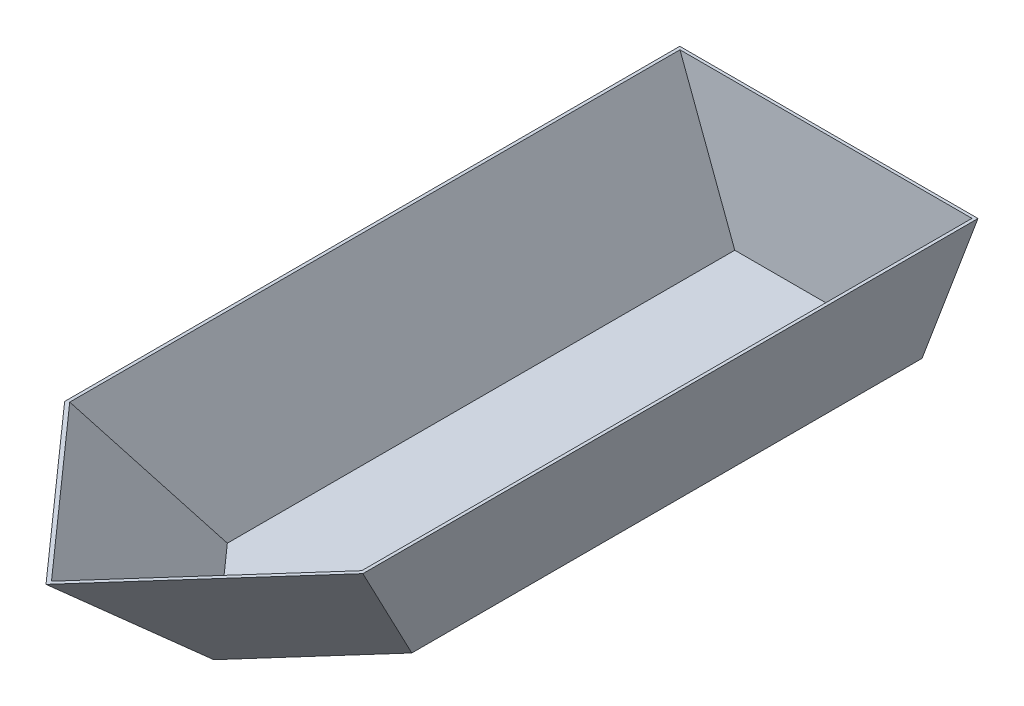
ISO-10303-21;
HEADER;
FILE_DESCRIPTION(('STEP AP214'),'2;1');
FILE_NAME('part.step','',(''),(''),'','','');
FILE_SCHEMA(('AUTOMOTIVE_DESIGN { 1 0 10303 214 1 1 1 1 }'));
ENDSEC;
DATA;
#1=APPLICATION_CONTEXT('core data for automotive mechanical design processes');
#2=APPLICATION_PROTOCOL_DEFINITION('international standard','automotive_design',2000,#1);
#3=PRODUCT_CONTEXT('',#1,'mechanical');
#4=PRODUCT('Part','Part','',(#3));
#5=PRODUCT_RELATED_PRODUCT_CATEGORY('part','',(#4));
#6=PRODUCT_DEFINITION_FORMATION('','',#4);
#7=PRODUCT_DEFINITION_CONTEXT('part definition',#1,'design');
#8=PRODUCT_DEFINITION('design','',#6,#7);
#9=PRODUCT_DEFINITION_SHAPE('','',#8);
#10=(LENGTH_UNIT() NAMED_UNIT(*) SI_UNIT(.MILLI.,.METRE.));
#11=(NAMED_UNIT(*) PLANE_ANGLE_UNIT() SI_UNIT($,.RADIAN.));
#12=(NAMED_UNIT(*) SI_UNIT($,.STERADIAN.) SOLID_ANGLE_UNIT());
#13=UNCERTAINTY_MEASURE_WITH_UNIT(LENGTH_MEASURE(1.E-05),#10,'distance_accuracy_value','');
#14=(GEOMETRIC_REPRESENTATION_CONTEXT(3) GLOBAL_UNCERTAINTY_ASSIGNED_CONTEXT((#13)) GLOBAL_UNIT_ASSIGNED_CONTEXT((#10,
#11,#12)) REPRESENTATION_CONTEXT('',''));
#15=CARTESIAN_POINT('',(0.,0.,0.));
#16=DIRECTION('',(0.,0.,1.));
#17=DIRECTION('',(1.,0.,0.));
#18=AXIS2_PLACEMENT_3D('',#15,#16,#17);
#19=CARTESIAN_POINT('',(660.4,406.4,2133.6));
#20=DIRECTION('',(0.,-1.,0.));
#21=DIRECTION('',(0.,0.,-1.));
#22=AXIS2_PLACEMENT_3D('',#19,#20,#21);
#23=PLANE('',#22);
#24=DIRECTION('',(0.66436383882992,0.,0.74740931868366));
#25=VECTOR('',#24,1.);
#26=CARTESIAN_POINT('',(-1501.75378137035,406.4,158.376995958358));
#27=LINE('',#26,#25);
#28=CARTESIAN_POINT('',(-152.4,406.4,1676.4));
#29=VERTEX_POINT('',#28);
#30=CARTESIAN_POINT('',(253.999999999999,406.4,2133.6));
#31=VERTEX_POINT('',#30);
#32=EDGE_CURVE('E167',#29,#31,#27,.T.);
#33=ORIENTED_EDGE('',*,*,#32,.T.);
#34=DIRECTION('',(-0.66436383882992,0.,0.74740931868366));
#35=VECTOR('',#34,1.);
#36=CARTESIAN_POINT('',(2009.75378137035,406.4,158.376995958358));
#37=LINE('',#36,#35);
#38=CARTESIAN_POINT('',(660.4,406.4,1676.4));
#39=VERTEX_POINT('',#38);
#40=EDGE_CURVE('E135',#39,#31,#37,.T.);
#41=ORIENTED_EDGE('',*,*,#40,.F.);
#42=DIRECTION('',(0.,0.,-1.));
#43=VECTOR('',#42,1.);
#44=CARTESIAN_POINT('',(660.4,406.4,2133.6));
#45=LINE('',#44,#43);
#46=CARTESIAN_POINT('',(660.4,406.4,0.));
#47=VERTEX_POINT('',#46);
#48=EDGE_CURVE('E183',#39,#47,#45,.T.);
#49=ORIENTED_EDGE('',*,*,#48,.T.);
#50=DIRECTION('',(-1.,0.,0.));
#51=VECTOR('',#50,1.);
#52=CARTESIAN_POINT('',(660.4,406.4,0.));
#53=LINE('',#52,#51);
#54=CARTESIAN_POINT('',(-152.4,406.4,0.));
#55=VERTEX_POINT('',#54);
#56=EDGE_CURVE('E180',#47,#55,#53,.T.);
#57=ORIENTED_EDGE('',*,*,#56,.T.);
#58=DIRECTION('',(0.,0.,-1.));
#59=VECTOR('',#58,1.);
#60=CARTESIAN_POINT('',(-152.4,406.4,2133.6));
#61=LINE('',#60,#59);
#62=EDGE_CURVE('E56',#29,#55,#61,.T.);
#63=ORIENTED_EDGE('',*,*,#62,.F.);
#64=EDGE_LOOP('',(#33,#41,#49,#57,#63));
#65=FACE_BOUND('',#64,.T.);
#66=DIRECTION('',(0.66436383882992,0.,0.74740931868366));
#67=VECTOR('',#66,1.);
#68=CARTESIAN_POINT('',(-1494.34729095635,406.4,151.793448923691));
#69=LINE('',#68,#67);
#70=CARTESIAN_POINT('',(-143.922746283943,406.4,1671.02106168015));
#71=VERTEX_POINT('',#70);
#72=CARTESIAN_POINT('',(254.,406.4,2118.68415124958));
#73=VERTEX_POINT('',#72);
#74=EDGE_CURVE('E120',#71,#73,#69,.T.);
#75=ORIENTED_EDGE('',*,*,#74,.F.);
#76=DIRECTION('',(0.,0.,-1.));
#77=VECTOR('',#76,1.);
#78=CARTESIAN_POINT('',(-143.922746283943,406.4,2133.6));
#79=LINE('',#78,#77);
#80=CARTESIAN_POINT('',(-143.922746283943,406.4,7.9375));
#81=VERTEX_POINT('',#80);
#82=EDGE_CURVE('E116',#71,#81,#79,.T.);
#83=ORIENTED_EDGE('',*,*,#82,.T.);
#84=DIRECTION('',(-1.,0.,0.));
#85=VECTOR('',#84,1.);
#86=CARTESIAN_POINT('',(660.4,406.4,7.93750000000015));
#87=LINE('',#86,#85);
#88=CARTESIAN_POINT('',(651.922746283943,406.4,7.9375));
#89=VERTEX_POINT('',#88);
#90=EDGE_CURVE('E149',#89,#81,#87,.T.);
#91=ORIENTED_EDGE('',*,*,#90,.F.);
#92=DIRECTION('',(0.,0.,-1.));
#93=VECTOR('',#92,1.);
#94=CARTESIAN_POINT('',(651.922746283943,406.4,2133.6));
#95=LINE('',#94,#93);
#96=CARTESIAN_POINT('',(651.922746283943,406.4,1671.02106168015));
#97=VERTEX_POINT('',#96);
#98=EDGE_CURVE('E137',#97,#89,#95,.T.);
#99=ORIENTED_EDGE('',*,*,#98,.F.);
#100=DIRECTION('',(-0.66436383882992,0.,0.74740931868366));
#101=VECTOR('',#100,1.);
#102=CARTESIAN_POINT('',(2002.34729095635,406.4,151.793448923691));
#103=LINE('',#102,#101);
#104=EDGE_CURVE('E142',#97,#73,#103,.T.);
#105=ORIENTED_EDGE('',*,*,#104,.T.);
#106=EDGE_LOOP('',(#75,#83,#91,#99,#105));
#107=FACE_BOUND('',#106,.T.);
#108=ADVANCED_FACE('F33',(#65,#107),#23,.F.);
#109=CARTESIAN_POINT('',(-152.4,406.4,2133.6));
#110=DIRECTION('',(0.936329177569045,0.351123441588392,0.));
#111=DIRECTION('',(-0.351123441588392,0.936329177569045,0.));
#112=AXIS2_PLACEMENT_3D('',#109,#110,#111);
#113=PLANE('',#112);
#114=DIRECTION('',(0.293272331791282,-0.78205955144342,-0.549885622108654));
#115=VECTOR('',#114,1.);
#116=CARTESIAN_POINT('',(-226.13092429446,603.015798118561,1814.64548305211));
#117=LINE('',#116,#115);
#118=CARTESIAN_POINT('',(2.22044604925031E-13,0.,1390.65));
#119=VERTEX_POINT('',#118);
#120=EDGE_CURVE('E170',#29,#119,#117,.T.);
#121=ORIENTED_EDGE('',*,*,#120,.F.);
#122=ORIENTED_EDGE('',*,*,#62,.T.);
#123=DIRECTION('',(0.351123441588392,-0.936329177569045,0.));
#124=VECTOR('',#123,1.);
#125=CARTESIAN_POINT('',(-152.4,406.4,0.));
#126=LINE('',#125,#124);
#127=CARTESIAN_POINT('',(0.,0.,0.));
#128=VERTEX_POINT('',#127);
#129=EDGE_CURVE('E172',#55,#128,#126,.T.);
#130=ORIENTED_EDGE('',*,*,#129,.T.);
#131=DIRECTION('',(0.,0.,-1.));
#132=VECTOR('',#131,1.);
#133=CARTESIAN_POINT('',(0.,0.,2133.6));
#134=LINE('',#133,#132);
#135=EDGE_CURVE('E41',#119,#128,#134,.T.);
#136=ORIENTED_EDGE('',*,*,#135,.F.);
#137=EDGE_LOOP('',(#121,#122,#130,#136));
#138=FACE_BOUND('',#137,.T.);
#139=ADVANCED_FACE('F35',(#138),#113,.F.);
#140=CARTESIAN_POINT('',(0.,0.,2133.6));
#141=DIRECTION('',(0.,1.,0.));
#142=DIRECTION('',(0.,0.,1.));
#143=AXIS2_PLACEMENT_3D('',#140,#141,#142);
#144=PLANE('',#143);
#145=DIRECTION('',(0.,0.,-1.));
#146=VECTOR('',#145,1.);
#147=CARTESIAN_POINT('',(508.,0.,2133.6));
#148=LINE('',#147,#146);
#149=CARTESIAN_POINT('',(508.,0.,1390.65));
#150=VERTEX_POINT('',#149);
#151=CARTESIAN_POINT('',(508.,0.,0.));
#152=VERTEX_POINT('',#151);
#153=EDGE_CURVE('E185',#150,#152,#148,.T.);
#154=ORIENTED_EDGE('',*,*,#153,.F.);
#155=DIRECTION('',(-0.66436383882992,0.,0.74740931868366));
#156=VECTOR('',#155,1.);
#157=CARTESIAN_POINT('',(2009.75378137035,0.,-298.823004041642));
#158=LINE('',#157,#156);
#159=CARTESIAN_POINT('',(254.,0.,1676.4));
#160=VERTEX_POINT('',#159);
#161=EDGE_CURVE('E158',#150,#160,#158,.T.);
#162=ORIENTED_EDGE('',*,*,#161,.T.);
#163=DIRECTION('',(0.66436383882992,0.,0.74740931868366));
#164=VECTOR('',#163,1.);
#165=CARTESIAN_POINT('',(-1501.75378137035,0.,-298.823004041642));
#166=LINE('',#165,#164);
#167=EDGE_CURVE('E164',#119,#160,#166,.T.);
#168=ORIENTED_EDGE('',*,*,#167,.F.);
#169=ORIENTED_EDGE('',*,*,#135,.T.);
#170=DIRECTION('',(1.,0.,0.));
#171=VECTOR('',#170,1.);
#172=CARTESIAN_POINT('',(0.,0.,0.));
#173=LINE('',#172,#171);
#174=EDGE_CURVE('E174',#128,#152,#173,.T.);
#175=ORIENTED_EDGE('',*,*,#174,.T.);
#176=EDGE_LOOP('',(#154,#162,#168,#169,#175));
#177=FACE_BOUND('',#176,.T.);
#178=ADVANCED_FACE('F191',(#177),#144,.F.);
#179=CARTESIAN_POINT('',(508.,0.,2133.6));
#180=DIRECTION('',(-0.936329177569045,0.351123441588392,0.));
#181=DIRECTION('',(-0.351123441588392,-0.936329177569045,0.));
#182=AXIS2_PLACEMENT_3D('',#179,#180,#181);
#183=PLANE('',#182);
#184=ORIENTED_EDGE('',*,*,#48,.F.);
#185=DIRECTION('',(-0.293272331791282,-0.78205955144342,-0.549885622108654));
#186=VECTOR('',#185,1.);
#187=CARTESIAN_POINT('',(627.812751978498,319.500671942661,1615.29890995968));
#188=LINE('',#187,#186);
#189=EDGE_CURVE('E161',#39,#150,#188,.T.);
#190=ORIENTED_EDGE('',*,*,#189,.T.);
#191=ORIENTED_EDGE('',*,*,#153,.T.);
#192=DIRECTION('',(0.351123441588392,0.936329177569045,0.));
#193=VECTOR('',#192,1.);
#194=CARTESIAN_POINT('',(508.,0.,0.));
#195=LINE('',#194,#193);
#196=EDGE_CURVE('E177',#152,#47,#195,.T.);
#197=ORIENTED_EDGE('',*,*,#196,.T.);
#198=EDGE_LOOP('',(#184,#190,#191,#197));
#199=FACE_BOUND('',#198,.T.);
#200=ADVANCED_FACE('F202',(#199),#183,.F.);
#201=CARTESIAN_POINT('',(0.,0.,0.));
#202=DIRECTION('',(0.,0.,1.));
#203=DIRECTION('',(1.,0.,0.));
#204=AXIS2_PLACEMENT_3D('',#201,#202,#203);
#205=PLANE('',#204);
#206=ORIENTED_EDGE('',*,*,#129,.F.);
#207=ORIENTED_EDGE('',*,*,#56,.F.);
#208=ORIENTED_EDGE('',*,*,#196,.F.);
#209=ORIENTED_EDGE('',*,*,#174,.F.);
#210=EDGE_LOOP('',(#206,#207,#208,#209));
#211=FACE_BOUND('',#210,.T.);
#212=ADVANCED_FACE('F195',(#211),#205,.F.);
#213=CARTESIAN_POINT('',(-1501.75378137035,406.4,158.376995958358));
#214=DIRECTION('',(-0.598671094713965,-0.598671094713965,0.532152084190192));
#215=DIRECTION('',(0.707106781186547,-0.707106781186548,0.));
#216=AXIS2_PLACEMENT_3D('',#213,#214,#215);
#217=PLANE('',#216);
#218=DIRECTION('',(0.,-0.66436383882992,-0.747409318683659));
#219=VECTOR('',#218,1.);
#220=CARTESIAN_POINT('',(254.,-574.400388213781,1030.1995632595));
#221=LINE('',#220,#219);
#222=EDGE_CURVE('E11',#31,#160,#221,.T.);
#223=ORIENTED_EDGE('',*,*,#222,.F.);
#224=ORIENTED_EDGE('',*,*,#32,.F.);
#225=ORIENTED_EDGE('',*,*,#120,.T.);
#226=ORIENTED_EDGE('',*,*,#167,.T.);
#227=EDGE_LOOP('',(#223,#224,#225,#226));
#228=FACE_BOUND('',#227,.T.);
#229=ADVANCED_FACE('F216',(#228),#217,.T.);
#230=CARTESIAN_POINT('',(2009.75378137035,406.4,158.376995958358));
#231=DIRECTION('',(-0.598671094713965,0.598671094713965,-0.532152084190192));
#232=DIRECTION('',(-0.707106781186547,-0.707106781186548,0.));
#233=AXIS2_PLACEMENT_3D('',#230,#231,#232);
#234=PLANE('',#233);
#235=ORIENTED_EDGE('',*,*,#40,.T.);
#236=ORIENTED_EDGE('',*,*,#222,.T.);
#237=ORIENTED_EDGE('',*,*,#161,.F.);
#238=ORIENTED_EDGE('',*,*,#189,.F.);
#239=EDGE_LOOP('',(#235,#236,#237,#238));
#240=FACE_BOUND('',#239,.T.);
#241=ADVANCED_FACE('F221',(#240),#234,.F.);
#242=CARTESIAN_POINT('',(-144.967887153046,409.187042317608,2133.6));
#243=DIRECTION('',(0.936329177569045,0.351123441588392,0.));
#244=DIRECTION('',(-0.351123441588392,0.936329177569045,0.));
#245=AXIS2_PLACEMENT_3D('',#242,#243,#244);
#246=PLANE('',#245);
#247=DIRECTION('',(0.293272331791282,-0.78205955144342,-0.549885622108654));
#248=VECTOR('',#247,1.);
#249=CARTESIAN_POINT('',(-219.25022896662,607.273287153806,1812.26009171017));
#250=LINE('',#249,#248);
#251=CARTESIAN_POINT('',(5.50069121605727,7.9375,1390.85211636765));
#252=VERTEX_POINT('',#251);
#253=EDGE_CURVE('E109',#71,#252,#250,.T.);
#254=ORIENTED_EDGE('',*,*,#253,.T.);
#255=DIRECTION('',(0.,0.,-1.));
#256=VECTOR('',#255,1.);
#257=CARTESIAN_POINT('',(5.50069121605727,7.9375,2133.6));
#258=LINE('',#257,#256);
#259=CARTESIAN_POINT('',(5.50069121605725,7.9375,7.9375));
#260=VERTEX_POINT('',#259);
#261=EDGE_CURVE('E113',#252,#260,#258,.T.);
#262=ORIENTED_EDGE('',*,*,#261,.T.);
#263=DIRECTION('',(0.351123441588392,-0.936329177569045,0.));
#264=VECTOR('',#263,1.);
#265=CARTESIAN_POINT('',(-144.967887153046,409.187042317608,7.93750000000015));
#266=LINE('',#265,#264);
#267=EDGE_CURVE('E48',#81,#260,#266,.T.);
#268=ORIENTED_EDGE('',*,*,#267,.F.);
#269=ORIENTED_EDGE('',*,*,#82,.F.);
#270=EDGE_LOOP('',(#254,#262,#268,#269));
#271=FACE_BOUND('',#270,.T.);
#272=ADVANCED_FACE('F111',(#271),#246,.T.);
#273=CARTESIAN_POINT('',(0.,7.9375,2133.6));
#274=DIRECTION('',(0.,1.,0.));
#275=DIRECTION('',(0.,0.,1.));
#276=AXIS2_PLACEMENT_3D('',#273,#274,#275);
#277=PLANE('',#276);
#278=DIRECTION('',(0.,0.,-1.));
#279=VECTOR('',#278,1.);
#280=CARTESIAN_POINT('',(502.499308783943,7.9375,2133.6));
#281=LINE('',#280,#279);
#282=CARTESIAN_POINT('',(502.499308783943,7.9375,1390.85211636765));
#283=VERTEX_POINT('',#282);
#284=CARTESIAN_POINT('',(502.499308783943,7.9375,7.9375));
#285=VERTEX_POINT('',#284);
#286=EDGE_CURVE('E133',#283,#285,#281,.T.);
#287=ORIENTED_EDGE('',*,*,#286,.T.);
#288=DIRECTION('',(1.,0.,0.));
#289=VECTOR('',#288,1.);
#290=CARTESIAN_POINT('',(0.,7.9375,7.93750000000015));
#291=LINE('',#290,#289);
#292=EDGE_CURVE('E132',#260,#285,#291,.T.);
#293=ORIENTED_EDGE('',*,*,#292,.F.);
#294=ORIENTED_EDGE('',*,*,#261,.F.);
#295=DIRECTION('',(0.66436383882992,0.,0.74740931868366));
#296=VECTOR('',#295,1.);
#297=CARTESIAN_POINT('',(371.885542138138,7.9375,1803.03507365499));
#298=LINE('',#297,#296);
#299=CARTESIAN_POINT('',(254.,7.9375,1670.41383874958));
#300=VERTEX_POINT('',#299);
#301=EDGE_CURVE('E123',#252,#300,#298,.T.);
#302=ORIENTED_EDGE('',*,*,#301,.T.);
#303=DIRECTION('',(-0.66436383882992,0.,0.74740931868366));
#304=VECTOR('',#303,1.);
#305=CARTESIAN_POINT('',(-88.1062317933104,7.9375,2055.28334951706));
#306=LINE('',#305,#304);
#307=EDGE_CURVE('E141',#283,#300,#306,.T.);
#308=ORIENTED_EDGE('',*,*,#307,.F.);
#309=EDGE_LOOP('',(#287,#293,#294,#302,#308));
#310=FACE_BOUND('',#309,.T.);
#311=ADVANCED_FACE('F130',(#310),#277,.T.);
#312=CARTESIAN_POINT('',(500.567887153046,2.78704231760786,2133.6));
#313=DIRECTION('',(-0.936329177569045,0.351123441588392,0.));
#314=DIRECTION('',(-0.351123441588392,-0.936329177569045,0.));
#315=AXIS2_PLACEMENT_3D('',#312,#313,#314);
#316=PLANE('',#315);
#317=ORIENTED_EDGE('',*,*,#98,.T.);
#318=DIRECTION('',(0.351123441588392,0.936329177569045,0.));
#319=VECTOR('',#318,1.);
#320=CARTESIAN_POINT('',(500.567887153046,2.78704231760786,7.93750000000015));
#321=LINE('',#320,#319);
#322=EDGE_CURVE('E145',#285,#89,#321,.T.);
#323=ORIENTED_EDGE('',*,*,#322,.F.);
#324=ORIENTED_EDGE('',*,*,#286,.F.);
#325=DIRECTION('',(-0.293272331791282,-0.78205955144342,-0.549885622108654));
#326=VECTOR('',#325,1.);
#327=CARTESIAN_POINT('',(620.932056650658,323.758160977906,1612.91351861774));
#328=LINE('',#327,#326);
#329=EDGE_CURVE('E128',#97,#283,#328,.T.);
#330=ORIENTED_EDGE('',*,*,#329,.F.);
#331=EDGE_LOOP('',(#317,#323,#324,#330));
#332=FACE_BOUND('',#331,.T.);
#333=ADVANCED_FACE('F238',(#332),#316,.T.);
#334=CARTESIAN_POINT('',(0.,0.,7.9375));
#335=DIRECTION('',(0.,0.,1.));
#336=DIRECTION('',(1.,0.,0.));
#337=AXIS2_PLACEMENT_3D('',#334,#335,#336);
#338=PLANE('',#337);
#339=ORIENTED_EDGE('',*,*,#267,.T.);
#340=ORIENTED_EDGE('',*,*,#292,.T.);
#341=ORIENTED_EDGE('',*,*,#322,.T.);
#342=ORIENTED_EDGE('',*,*,#90,.T.);
#343=EDGE_LOOP('',(#339,#340,#341,#342));
#344=FACE_BOUND('',#343,.T.);
#345=ADVANCED_FACE('F235',(#344),#338,.T.);
#346=CARTESIAN_POINT('',(-1497.00182955606,411.151951814292,154.153038790098));
#347=DIRECTION('',(-0.598671094713965,-0.598671094713965,0.532152084190192));
#348=DIRECTION('',(0.707106781186547,-0.707106781186548,0.));
#349=AXIS2_PLACEMENT_3D('',#346,#347,#348);
#350=PLANE('',#349);
#351=DIRECTION('',(0.,-0.66436383882992,-0.747409318683659));
#352=VECTOR('',#351,1.);
#353=CARTESIAN_POINT('',(254.,-566.993897799781,1023.61601622483));
#354=LINE('',#353,#352);
#355=EDGE_CURVE('E125',#73,#300,#354,.T.);
#356=ORIENTED_EDGE('',*,*,#355,.T.);
#357=ORIENTED_EDGE('',*,*,#301,.F.);
#358=ORIENTED_EDGE('',*,*,#253,.F.);
#359=ORIENTED_EDGE('',*,*,#74,.T.);
#360=EDGE_LOOP('',(#356,#357,#358,#359));
#361=FACE_BOUND('',#360,.T.);
#362=ADVANCED_FACE('F124',(#361),#350,.F.);
#363=CARTESIAN_POINT('',(2005.00182955606,411.151951814292,154.153038790098));
#364=DIRECTION('',(-0.598671094713965,0.598671094713965,-0.532152084190192));
#365=DIRECTION('',(-0.707106781186547,-0.707106781186548,0.));
#366=AXIS2_PLACEMENT_3D('',#363,#364,#365);
#367=PLANE('',#366);
#368=ORIENTED_EDGE('',*,*,#104,.F.);
#369=ORIENTED_EDGE('',*,*,#329,.T.);
#370=ORIENTED_EDGE('',*,*,#307,.T.);
#371=ORIENTED_EDGE('',*,*,#355,.F.);
#372=EDGE_LOOP('',(#368,#369,#370,#371));
#373=FACE_BOUND('',#372,.T.);
#374=ADVANCED_FACE('F229',(#373),#367,.T.);
#375=CLOSED_SHELL('',(#108,#139,#178,#200,#212,#229,#241,#272,#311,#333,#345,#362,#374));
#376=MANIFOLD_SOLID_BREP('B2',#375);
#377=ADVANCED_BREP_SHAPE_REPRESENTATION('',(#18,#376),#14);
#378=SHAPE_DEFINITION_REPRESENTATION(#9,#377);
ENDSEC;
END-ISO-10303-21;
